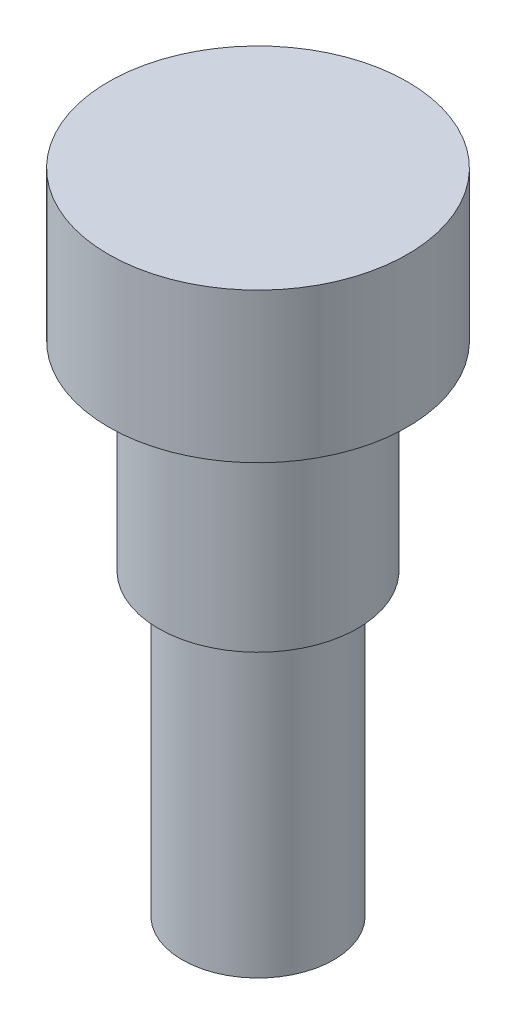
ISO-10303-21;
HEADER;
FILE_DESCRIPTION(('STEP AP214'),'2;1');
FILE_NAME('part.step','',(''),(''),'','','');
FILE_SCHEMA(('AUTOMOTIVE_DESIGN { 1 0 10303 214 1 1 1 1 }'));
ENDSEC;
DATA;
#1=APPLICATION_CONTEXT('core data for automotive mechanical design processes');
#2=APPLICATION_PROTOCOL_DEFINITION('international standard','automotive_design',2000,#1);
#3=PRODUCT_CONTEXT('',#1,'mechanical');
#4=PRODUCT('Part','Part','',(#3));
#5=PRODUCT_RELATED_PRODUCT_CATEGORY('part','',(#4));
#6=PRODUCT_DEFINITION_FORMATION('','',#4);
#7=PRODUCT_DEFINITION_CONTEXT('part definition',#1,'design');
#8=PRODUCT_DEFINITION('design','',#6,#7);
#9=PRODUCT_DEFINITION_SHAPE('','',#8);
#10=(LENGTH_UNIT() NAMED_UNIT(*) SI_UNIT(.MILLI.,.METRE.));
#11=(NAMED_UNIT(*) PLANE_ANGLE_UNIT() SI_UNIT($,.RADIAN.));
#12=(NAMED_UNIT(*) SI_UNIT($,.STERADIAN.) SOLID_ANGLE_UNIT());
#13=UNCERTAINTY_MEASURE_WITH_UNIT(LENGTH_MEASURE(1.E-05),#10,'distance_accuracy_value','');
#14=(GEOMETRIC_REPRESENTATION_CONTEXT(3) GLOBAL_UNCERTAINTY_ASSIGNED_CONTEXT((#13)) GLOBAL_UNIT_ASSIGNED_CONTEXT((#10,
#11,#12)) REPRESENTATION_CONTEXT('',''));
#15=CARTESIAN_POINT('',(0.,0.,0.));
#16=DIRECTION('',(0.,0.,1.));
#17=DIRECTION('',(1.,0.,0.));
#18=AXIS2_PLACEMENT_3D('',#15,#16,#17);
#19=CARTESIAN_POINT('',(0.,-9.525,0.));
#20=DIRECTION('',(0.,1.,0.));
#21=DIRECTION('',(0.,0.,1.));
#22=AXIS2_PLACEMENT_3D('',#19,#20,#21);
#23=PLANE('',#22);
#24=CARTESIAN_POINT('',(0.,-9.525,0.));
#25=DIRECTION('',(0.,1.,0.));
#26=DIRECTION('',(0.,0.,1.));
#27=AXIS2_PLACEMENT_3D('',#24,#25,#26);
#28=CIRCLE('',#27,2.41300000000001);
#29=CARTESIAN_POINT('',(0.,-9.525,2.41300000000001));
#30=VERTEX_POINT('',#29);
#31=EDGE_CURVE('E10',#30,#30,#28,.T.);
#32=ORIENTED_EDGE('',*,*,#31,.F.);
#33=EDGE_LOOP('',(#32));
#34=FACE_BOUND('',#33,.T.);
#35=ADVANCED_FACE('F358',(#34),#23,.F.);
#36=CARTESIAN_POINT('',(0.,32.6392664509169,0.));
#37=DIRECTION('',(0.,1.,0.));
#38=DIRECTION('',(0.,0.,1.));
#39=AXIS2_PLACEMENT_3D('',#36,#37,#38);
#40=CYLINDRICAL_SURFACE('',#39,2.41300000000001);
#41=CARTESIAN_POINT('',(0.,0.,0.));
#42=DIRECTION('',(0.,1.,0.));
#43=DIRECTION('',(0.,0.,1.));
#44=AXIS2_PLACEMENT_3D('',#41,#42,#43);
#45=CIRCLE('',#44,2.41300000000001);
#46=CARTESIAN_POINT('',(0.,0.,2.41300000000001));
#47=VERTEX_POINT('',#46);
#48=EDGE_CURVE('E364',#47,#47,#45,.T.);
#49=ORIENTED_EDGE('',*,*,#48,.F.);
#50=EDGE_LOOP('',(#49));
#51=FACE_BOUND('',#50,.T.);
#52=ORIENTED_EDGE('',*,*,#31,.T.);
#53=EDGE_LOOP('',(#52));
#54=FACE_BOUND('',#53,.T.);
#55=ADVANCED_FACE('F406',(#51,#54),#40,.T.);
#56=CARTESIAN_POINT('',(2.41300000000001,0.,0.));
#57=DIRECTION('',(0.,1.,0.));
#58=DIRECTION('',(0.,0.,1.));
#59=AXIS2_PLACEMENT_3D('',#56,#57,#58);
#60=PLANE('',#59);
#61=CARTESIAN_POINT('',(0.,0.,0.));
#62=DIRECTION('',(0.,1.,0.));
#63=DIRECTION('',(0.,0.,1.));
#64=AXIS2_PLACEMENT_3D('',#61,#62,#63);
#65=CIRCLE('',#64,3.175);
#66=CARTESIAN_POINT('',(0.,0.,3.175));
#67=VERTEX_POINT('',#66);
#68=EDGE_CURVE('E368',#67,#67,#65,.T.);
#69=ORIENTED_EDGE('',*,*,#68,.F.);
#70=EDGE_LOOP('',(#69));
#71=FACE_BOUND('',#70,.T.);
#72=ORIENTED_EDGE('',*,*,#48,.T.);
#73=EDGE_LOOP('',(#72));
#74=FACE_BOUND('',#73,.T.);
#75=ADVANCED_FACE('F401',(#71,#74),#60,.F.);
#76=CARTESIAN_POINT('',(0.,32.6392664509169,0.));
#77=DIRECTION('',(0.,1.,0.));
#78=DIRECTION('',(0.,0.,1.));
#79=AXIS2_PLACEMENT_3D('',#76,#77,#78);
#80=CYLINDRICAL_SURFACE('',#79,3.175);
#81=CARTESIAN_POINT('',(0.,6.35,0.));
#82=DIRECTION('',(0.,1.,0.));
#83=DIRECTION('',(0.,0.,1.));
#84=AXIS2_PLACEMENT_3D('',#81,#82,#83);
#85=CIRCLE('',#84,3.175);
#86=CARTESIAN_POINT('',(0.,6.35,3.175));
#87=VERTEX_POINT('',#86);
#88=EDGE_CURVE('E372',#87,#87,#85,.T.);
#89=ORIENTED_EDGE('',*,*,#88,.F.);
#90=EDGE_LOOP('',(#89));
#91=FACE_BOUND('',#90,.T.);
#92=ORIENTED_EDGE('',*,*,#68,.T.);
#93=EDGE_LOOP('',(#92));
#94=FACE_BOUND('',#93,.T.);
#95=ADVANCED_FACE('F395',(#91,#94),#80,.T.);
#96=CARTESIAN_POINT('',(3.175,6.35,0.));
#97=DIRECTION('',(0.,1.,0.));
#98=DIRECTION('',(0.,0.,1.));
#99=AXIS2_PLACEMENT_3D('',#96,#97,#98);
#100=PLANE('',#99);
#101=CARTESIAN_POINT('',(0.,6.35,0.));
#102=DIRECTION('',(0.,1.,0.));
#103=DIRECTION('',(0.,0.,1.));
#104=AXIS2_PLACEMENT_3D('',#101,#102,#103);
#105=CIRCLE('',#104,4.7625);
#106=CARTESIAN_POINT('',(0.,6.35,4.7625));
#107=VERTEX_POINT('',#106);
#108=EDGE_CURVE('E377',#107,#107,#105,.T.);
#109=ORIENTED_EDGE('',*,*,#108,.F.);
#110=EDGE_LOOP('',(#109));
#111=FACE_BOUND('',#110,.T.);
#112=ORIENTED_EDGE('',*,*,#88,.T.);
#113=EDGE_LOOP('',(#112));
#114=FACE_BOUND('',#113,.T.);
#115=ADVANCED_FACE('F389',(#111,#114),#100,.F.);
#116=CARTESIAN_POINT('',(0.,32.6392664509169,0.));
#117=DIRECTION('',(0.,1.,0.));
#118=DIRECTION('',(0.,0.,1.));
#119=AXIS2_PLACEMENT_3D('',#116,#117,#118);
#120=CYLINDRICAL_SURFACE('',#119,4.7625);
#121=CARTESIAN_POINT('',(0.,11.1125,0.));
#122=DIRECTION('',(0.,1.,0.));
#123=DIRECTION('',(0.,0.,1.));
#124=AXIS2_PLACEMENT_3D('',#121,#122,#123);
#125=CIRCLE('',#124,4.7625);
#126=CARTESIAN_POINT('',(0.,11.1125,4.7625));
#127=VERTEX_POINT('',#126);
#128=EDGE_CURVE('E380',#127,#127,#125,.T.);
#129=ORIENTED_EDGE('',*,*,#128,.F.);
#130=EDGE_LOOP('',(#129));
#131=FACE_BOUND('',#130,.T.);
#132=ORIENTED_EDGE('',*,*,#108,.T.);
#133=EDGE_LOOP('',(#132));
#134=FACE_BOUND('',#133,.T.);
#135=ADVANCED_FACE('F386',(#131,#134),#120,.T.);
#136=CARTESIAN_POINT('',(4.7625,11.1125,0.));
#137=DIRECTION('',(0.,-1.,0.));
#138=DIRECTION('',(0.,0.,-1.));
#139=AXIS2_PLACEMENT_3D('',#136,#137,#138);
#140=PLANE('',#139);
#141=ORIENTED_EDGE('',*,*,#128,.T.);
#142=EDGE_LOOP('',(#141));
#143=FACE_BOUND('',#142,.T.);
#144=ADVANCED_FACE('F384',(#143),#140,.F.);
#145=CLOSED_SHELL('',(#35,#55,#75,#95,#115,#135,#144));
#146=MANIFOLD_SOLID_BREP('B2',#145);
#147=ADVANCED_BREP_SHAPE_REPRESENTATION('',(#18,#146),#14);
#148=SHAPE_DEFINITION_REPRESENTATION(#9,#147);
ENDSEC;
END-ISO-10303-21;
